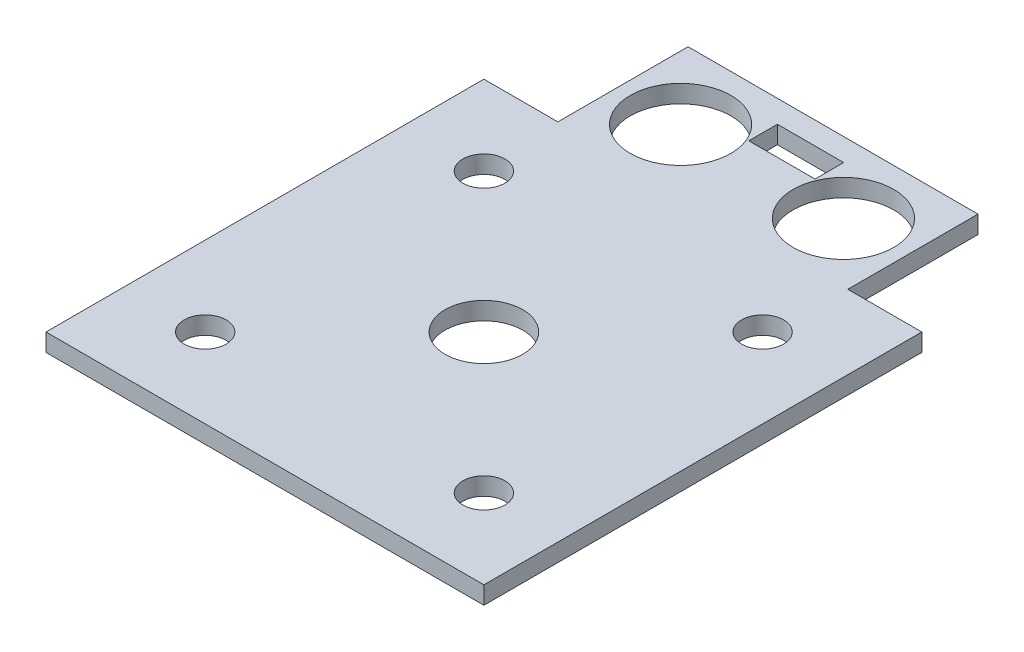
ISO-10303-21;
HEADER;
FILE_DESCRIPTION(('STEP AP214'),'2;1');
FILE_NAME('part.step','',(''),(''),'','','');
FILE_SCHEMA(('AUTOMOTIVE_DESIGN { 1 0 10303 214 1 1 1 1 }'));
ENDSEC;
DATA;
#1=APPLICATION_CONTEXT('core data for automotive mechanical design processes');
#2=APPLICATION_PROTOCOL_DEFINITION('international standard','automotive_design',2000,#1);
#3=PRODUCT_CONTEXT('',#1,'mechanical');
#4=PRODUCT('Part','Part','',(#3));
#5=PRODUCT_RELATED_PRODUCT_CATEGORY('part','',(#4));
#6=PRODUCT_DEFINITION_FORMATION('','',#4);
#7=PRODUCT_DEFINITION_CONTEXT('part definition',#1,'design');
#8=PRODUCT_DEFINITION('design','',#6,#7);
#9=PRODUCT_DEFINITION_SHAPE('','',#8);
#10=(LENGTH_UNIT() NAMED_UNIT(*) SI_UNIT(.MILLI.,.METRE.));
#11=(NAMED_UNIT(*) PLANE_ANGLE_UNIT() SI_UNIT($,.RADIAN.));
#12=(NAMED_UNIT(*) SI_UNIT($,.STERADIAN.) SOLID_ANGLE_UNIT());
#13=UNCERTAINTY_MEASURE_WITH_UNIT(LENGTH_MEASURE(1.E-05),#10,'distance_accuracy_value','');
#14=(GEOMETRIC_REPRESENTATION_CONTEXT(3) GLOBAL_UNCERTAINTY_ASSIGNED_CONTEXT((#13)) GLOBAL_UNIT_ASSIGNED_CONTEXT((#10,
#11,#12)) REPRESENTATION_CONTEXT('',''));
#15=CARTESIAN_POINT('',(0.,0.,0.));
#16=DIRECTION('',(0.,0.,1.));
#17=DIRECTION('',(1.,0.,0.));
#18=AXIS2_PLACEMENT_3D('',#15,#16,#17);
#19=CARTESIAN_POINT('',(0.,0.,0.));
#20=DIRECTION('',(0.,1.,0.));
#21=DIRECTION('',(0.,0.,1.));
#22=AXIS2_PLACEMENT_3D('',#19,#20,#21);
#23=PLANE('',#22);
#24=CARTESIAN_POINT('',(0.,0.,0.));
#25=DIRECTION('',(0.,1.,0.));
#26=DIRECTION('',(0.,0.,1.));
#27=AXIS2_PLACEMENT_3D('',#24,#25,#26);
#28=CIRCLE('',#27,21.);
#29=CARTESIAN_POINT('',(0.,0.,21.));
#30=VERTEX_POINT('',#29);
#31=EDGE_CURVE('E51',#30,#30,#28,.T.);
#32=ORIENTED_EDGE('',*,*,#31,.F.);
#33=EDGE_LOOP('',(#32));
#34=FACE_BOUND('',#33,.T.);
#35=CARTESIAN_POINT('',(0.,0.,0.));
#36=DIRECTION('',(0.,1.,0.));
#37=DIRECTION('',(0.,0.,1.));
#38=AXIS2_PLACEMENT_3D('',#35,#36,#37);
#39=CIRCLE('',#38,20.);
#40=CARTESIAN_POINT('',(0.,0.,20.));
#41=VERTEX_POINT('',#40);
#42=EDGE_CURVE('E205',#41,#41,#39,.T.);
#43=ORIENTED_EDGE('',*,*,#42,.T.);
#44=EDGE_LOOP('',(#43));
#45=FACE_BOUND('',#44,.T.);
#46=ADVANCED_FACE('F47',(#34,#45),#23,.F.);
#47=CARTESIAN_POINT('',(0.,3.5,0.));
#48=DIRECTION('',(0.,-1.,0.));
#49=DIRECTION('',(0.,0.,-1.));
#50=AXIS2_PLACEMENT_3D('',#47,#48,#49);
#51=CYLINDRICAL_SURFACE('',#50,21.);
#52=CARTESIAN_POINT('',(0.,3.5,0.));
#53=DIRECTION('',(0.,1.,0.));
#54=DIRECTION('',(0.,0.,1.));
#55=AXIS2_PLACEMENT_3D('',#52,#53,#54);
#56=CIRCLE('',#55,21.);
#57=CARTESIAN_POINT('',(0.,3.5,21.));
#58=VERTEX_POINT('',#57);
#59=EDGE_CURVE('E11',#58,#58,#56,.T.);
#60=ORIENTED_EDGE('',*,*,#59,.F.);
#61=EDGE_LOOP('',(#60));
#62=FACE_BOUND('',#61,.T.);
#63=ORIENTED_EDGE('',*,*,#31,.T.);
#64=EDGE_LOOP('',(#63));
#65=FACE_BOUND('',#64,.T.);
#66=ADVANCED_FACE('F49',(#62,#65),#51,.T.);
#67=CARTESIAN_POINT('',(0.,3.5,0.));
#68=DIRECTION('',(0.,-1.,0.));
#69=DIRECTION('',(0.,0.,-1.));
#70=AXIS2_PLACEMENT_3D('',#67,#68,#69);
#71=CYLINDRICAL_SURFACE('',#70,20.);
#72=CARTESIAN_POINT('',(0.,3.5,0.));
#73=DIRECTION('',(0.,1.,0.));
#74=DIRECTION('',(0.,0.,1.));
#75=AXIS2_PLACEMENT_3D('',#72,#73,#74);
#76=CIRCLE('',#75,20.);
#77=CARTESIAN_POINT('',(0.,3.5,20.));
#78=VERTEX_POINT('',#77);
#79=EDGE_CURVE('E173',#78,#78,#76,.T.);
#80=ORIENTED_EDGE('',*,*,#79,.T.);
#81=EDGE_LOOP('',(#80));
#82=FACE_BOUND('',#81,.T.);
#83=ORIENTED_EDGE('',*,*,#42,.F.);
#84=EDGE_LOOP('',(#83));
#85=FACE_BOUND('',#84,.T.);
#86=ADVANCED_FACE('F219',(#82,#85),#71,.F.);
#87=CARTESIAN_POINT('',(0.,3.5,0.));
#88=DIRECTION('',(0.,1.,0.));
#89=DIRECTION('',(0.,0.,1.));
#90=AXIS2_PLACEMENT_3D('',#87,#88,#89);
#91=PLANE('',#90);
#92=CARTESIAN_POINT('',(0.,3.5,0.));
#93=DIRECTION('',(0.,1.,0.));
#94=DIRECTION('',(0.,0.,1.));
#95=AXIS2_PLACEMENT_3D('',#92,#93,#94);
#96=CIRCLE('',#95,6.55);
#97=CARTESIAN_POINT('',(0.,3.5,6.55));
#98=VERTEX_POINT('',#97);
#99=EDGE_CURVE('E360',#98,#98,#96,.T.);
#100=ORIENTED_EDGE('',*,*,#99,.T.);
#101=EDGE_LOOP('',(#100));
#102=FACE_BOUND('',#101,.T.);
#103=ORIENTED_EDGE('',*,*,#79,.F.);
#104=EDGE_LOOP('',(#103));
#105=FACE_BOUND('',#104,.T.);
#106=ADVANCED_FACE('F224',(#102,#105),#91,.F.);
#107=CARTESIAN_POINT('',(5.6,6.5,0.));
#108=DIRECTION('',(-1.,0.,0.));
#109=DIRECTION('',(0.,0.,1.));
#110=AXIS2_PLACEMENT_3D('',#107,#108,#109);
#111=PLANE('',#110);
#112=DIRECTION('',(0.,0.,-1.));
#113=VECTOR('',#112,1.);
#114=CARTESIAN_POINT('',(5.6,3.5,0.));
#115=LINE('',#114,#113);
#116=CARTESIAN_POINT('',(5.6,3.5,-50.36));
#117=VERTEX_POINT('',#116);
#118=CARTESIAN_POINT('',(5.6,3.5,-55.2));
#119=VERTEX_POINT('',#118);
#120=EDGE_CURVE('E401',#117,#119,#115,.T.);
#121=ORIENTED_EDGE('',*,*,#120,.F.);
#122=DIRECTION('',(0.,-1.,0.));
#123=VECTOR('',#122,1.);
#124=CARTESIAN_POINT('',(5.6,6.5,-50.36));
#125=LINE('',#124,#123);
#126=CARTESIAN_POINT('',(5.6,6.5,-50.36));
#127=VERTEX_POINT('',#126);
#128=EDGE_CURVE('E169',#127,#117,#125,.T.);
#129=ORIENTED_EDGE('',*,*,#128,.F.);
#130=DIRECTION('',(0.,0.,-1.));
#131=VECTOR('',#130,1.);
#132=CARTESIAN_POINT('',(5.6,6.5,0.));
#133=LINE('',#132,#131);
#134=CARTESIAN_POINT('',(5.6,6.5,-55.2));
#135=VERTEX_POINT('',#134);
#136=EDGE_CURVE('E161',#127,#135,#133,.T.);
#137=ORIENTED_EDGE('',*,*,#136,.T.);
#138=DIRECTION('',(0.,-1.,0.));
#139=VECTOR('',#138,1.);
#140=CARTESIAN_POINT('',(5.6,6.5,-55.2));
#141=LINE('',#140,#139);
#142=EDGE_CURVE('E112',#135,#119,#141,.T.);
#143=ORIENTED_EDGE('',*,*,#142,.T.);
#144=EDGE_LOOP('',(#121,#129,#137,#143));
#145=FACE_BOUND('',#144,.T.);
#146=ADVANCED_FACE('F283',(#145),#111,.T.);
#147=CARTESIAN_POINT('',(0.,6.5,-50.36));
#148=DIRECTION('',(0.,0.,1.));
#149=DIRECTION('',(1.,0.,0.));
#150=AXIS2_PLACEMENT_3D('',#147,#148,#149);
#151=PLANE('',#150);
#152=DIRECTION('',(-1.,0.,0.));
#153=VECTOR('',#152,1.);
#154=CARTESIAN_POINT('',(0.,3.5,-50.36));
#155=LINE('',#154,#153);
#156=CARTESIAN_POINT('',(-5.6,3.5,-50.36));
#157=VERTEX_POINT('',#156);
#158=EDGE_CURVE('E167',#117,#157,#155,.T.);
#159=ORIENTED_EDGE('',*,*,#158,.T.);
#160=DIRECTION('',(0.,-1.,0.));
#161=VECTOR('',#160,1.);
#162=CARTESIAN_POINT('',(-5.6,6.5,-50.36));
#163=LINE('',#162,#161);
#164=CARTESIAN_POINT('',(-5.6,6.5,-50.36));
#165=VERTEX_POINT('',#164);
#166=EDGE_CURVE('E153',#165,#157,#163,.T.);
#167=ORIENTED_EDGE('',*,*,#166,.F.);
#168=DIRECTION('',(-1.,0.,0.));
#169=VECTOR('',#168,1.);
#170=CARTESIAN_POINT('',(0.,6.5,-50.36));
#171=LINE('',#170,#169);
#172=EDGE_CURVE('E157',#127,#165,#171,.T.);
#173=ORIENTED_EDGE('',*,*,#172,.F.);
#174=ORIENTED_EDGE('',*,*,#128,.T.);
#175=EDGE_LOOP('',(#159,#167,#173,#174));
#176=FACE_BOUND('',#175,.T.);
#177=ADVANCED_FACE('F165',(#176),#151,.F.);
#178=CARTESIAN_POINT('',(-5.6,6.5,0.));
#179=DIRECTION('',(-1.,0.,0.));
#180=DIRECTION('',(0.,0.,1.));
#181=AXIS2_PLACEMENT_3D('',#178,#179,#180);
#182=PLANE('',#181);
#183=DIRECTION('',(0.,0.,-1.));
#184=VECTOR('',#183,1.);
#185=CARTESIAN_POINT('',(-5.6,3.5,0.));
#186=LINE('',#185,#184);
#187=CARTESIAN_POINT('',(-5.6,3.5,-55.2));
#188=VERTEX_POINT('',#187);
#189=EDGE_CURVE('E406',#157,#188,#186,.T.);
#190=ORIENTED_EDGE('',*,*,#189,.T.);
#191=DIRECTION('',(0.,-1.,0.));
#192=VECTOR('',#191,1.);
#193=CARTESIAN_POINT('',(-5.6,6.5,-55.2));
#194=LINE('',#193,#192);
#195=CARTESIAN_POINT('',(-5.6,6.5,-55.2));
#196=VERTEX_POINT('',#195);
#197=EDGE_CURVE('E155',#196,#188,#194,.T.);
#198=ORIENTED_EDGE('',*,*,#197,.F.);
#199=DIRECTION('',(0.,0.,-1.));
#200=VECTOR('',#199,1.);
#201=CARTESIAN_POINT('',(-5.6,6.5,0.));
#202=LINE('',#201,#200);
#203=EDGE_CURVE('E148',#165,#196,#202,.T.);
#204=ORIENTED_EDGE('',*,*,#203,.F.);
#205=ORIENTED_EDGE('',*,*,#166,.T.);
#206=EDGE_LOOP('',(#190,#198,#204,#205));
#207=FACE_BOUND('',#206,.T.);
#208=ADVANCED_FACE('F151',(#207),#182,.F.);
#209=CARTESIAN_POINT('',(0.,6.5,37.));
#210=DIRECTION('',(0.,0.,-1.));
#211=DIRECTION('',(-1.,0.,0.));
#212=AXIS2_PLACEMENT_3D('',#209,#210,#211);
#213=PLANE('',#212);
#214=DIRECTION('',(1.,0.,0.));
#215=VECTOR('',#214,1.);
#216=CARTESIAN_POINT('',(0.,3.5,37.));
#217=LINE('',#216,#215);
#218=CARTESIAN_POINT('',(-37.,3.5,37.));
#219=VERTEX_POINT('',#218);
#220=CARTESIAN_POINT('',(37.,3.5,37.));
#221=VERTEX_POINT('',#220);
#222=EDGE_CURVE('E364',#219,#221,#217,.T.);
#223=ORIENTED_EDGE('',*,*,#222,.T.);
#224=DIRECTION('',(0.,-1.,0.));
#225=VECTOR('',#224,1.);
#226=CARTESIAN_POINT('',(37.,6.5,37.));
#227=LINE('',#226,#225);
#228=CARTESIAN_POINT('',(37.,6.5,37.));
#229=VERTEX_POINT('',#228);
#230=EDGE_CURVE('E199',#229,#221,#227,.T.);
#231=ORIENTED_EDGE('',*,*,#230,.F.);
#232=DIRECTION('',(1.,0.,0.));
#233=VECTOR('',#232,1.);
#234=CARTESIAN_POINT('',(0.,6.5,37.));
#235=LINE('',#234,#233);
#236=CARTESIAN_POINT('',(-37.,6.5,37.));
#237=VERTEX_POINT('',#236);
#238=EDGE_CURVE('E324',#237,#229,#235,.T.);
#239=ORIENTED_EDGE('',*,*,#238,.F.);
#240=DIRECTION('',(0.,-1.,0.));
#241=VECTOR('',#240,1.);
#242=CARTESIAN_POINT('',(-37.,6.5,37.));
#243=LINE('',#242,#241);
#244=EDGE_CURVE('E178',#237,#219,#243,.T.);
#245=ORIENTED_EDGE('',*,*,#244,.T.);
#246=EDGE_LOOP('',(#223,#231,#239,#245));
#247=FACE_BOUND('',#246,.T.);
#248=ADVANCED_FACE('F248',(#247),#213,.F.);
#249=CARTESIAN_POINT('',(37.,6.5,0.));
#250=DIRECTION('',(-1.,0.,0.));
#251=DIRECTION('',(0.,0.,1.));
#252=AXIS2_PLACEMENT_3D('',#249,#250,#251);
#253=PLANE('',#252);
#254=DIRECTION('',(0.,0.,-1.));
#255=VECTOR('',#254,1.);
#256=CARTESIAN_POINT('',(37.,3.5,0.));
#257=LINE('',#256,#255);
#258=CARTESIAN_POINT('',(37.,3.5,-37.));
#259=VERTEX_POINT('',#258);
#260=EDGE_CURVE('E368',#221,#259,#257,.T.);
#261=ORIENTED_EDGE('',*,*,#260,.T.);
#262=DIRECTION('',(0.,-1.,0.));
#263=VECTOR('',#262,1.);
#264=CARTESIAN_POINT('',(37.,6.5,-37.));
#265=LINE('',#264,#263);
#266=CARTESIAN_POINT('',(37.,6.5,-37.));
#267=VERTEX_POINT('',#266);
#268=EDGE_CURVE('E196',#267,#259,#265,.T.);
#269=ORIENTED_EDGE('',*,*,#268,.F.);
#270=DIRECTION('',(0.,0.,-1.));
#271=VECTOR('',#270,1.);
#272=CARTESIAN_POINT('',(37.,6.5,0.));
#273=LINE('',#272,#271);
#274=EDGE_CURVE('E120',#229,#267,#273,.T.);
#275=ORIENTED_EDGE('',*,*,#274,.F.);
#276=ORIENTED_EDGE('',*,*,#230,.T.);
#277=EDGE_LOOP('',(#261,#269,#275,#276));
#278=FACE_BOUND('',#277,.T.);
#279=ADVANCED_FACE('F251',(#278),#253,.F.);
#280=CARTESIAN_POINT('',(0.,6.5,-37.));
#281=DIRECTION('',(0.,0.,-1.));
#282=DIRECTION('',(-1.,0.,0.));
#283=AXIS2_PLACEMENT_3D('',#280,#281,#282);
#284=PLANE('',#283);
#285=DIRECTION('',(1.,0.,0.));
#286=VECTOR('',#285,1.);
#287=CARTESIAN_POINT('',(0.,3.5,-37.));
#288=LINE('',#287,#286);
#289=CARTESIAN_POINT('',(24.5,3.5,-37.));
#290=VERTEX_POINT('',#289);
#291=EDGE_CURVE('E372',#290,#259,#288,.T.);
#292=ORIENTED_EDGE('',*,*,#291,.F.);
#293=DIRECTION('',(0.,-1.,0.));
#294=VECTOR('',#293,1.);
#295=CARTESIAN_POINT('',(24.5,6.5,-37.));
#296=LINE('',#295,#294);
#297=CARTESIAN_POINT('',(24.5,6.5,-37.));
#298=VERTEX_POINT('',#297);
#299=EDGE_CURVE('E193',#298,#290,#296,.T.);
#300=ORIENTED_EDGE('',*,*,#299,.F.);
#301=DIRECTION('',(1.,0.,0.));
#302=VECTOR('',#301,1.);
#303=CARTESIAN_POINT('',(0.,6.5,-37.));
#304=LINE('',#303,#302);
#305=EDGE_CURVE('E426',#298,#267,#304,.T.);
#306=ORIENTED_EDGE('',*,*,#305,.T.);
#307=ORIENTED_EDGE('',*,*,#268,.T.);
#308=EDGE_LOOP('',(#292,#300,#306,#307));
#309=FACE_BOUND('',#308,.T.);
#310=ADVANCED_FACE('F255',(#309),#284,.T.);
#311=CARTESIAN_POINT('',(24.5,6.5,0.));
#312=DIRECTION('',(1.,0.,0.));
#313=DIRECTION('',(0.,0.,-1.));
#314=AXIS2_PLACEMENT_3D('',#311,#312,#313);
#315=PLANE('',#314);
#316=DIRECTION('',(0.,0.,1.));
#317=VECTOR('',#316,1.);
#318=CARTESIAN_POINT('',(24.5,3.5,0.));
#319=LINE('',#318,#317);
#320=CARTESIAN_POINT('',(24.5,3.5,-59.));
#321=VERTEX_POINT('',#320);
#322=EDGE_CURVE('E376',#321,#290,#319,.T.);
#323=ORIENTED_EDGE('',*,*,#322,.F.);
#324=DIRECTION('',(0.,-1.,0.));
#325=VECTOR('',#324,1.);
#326=CARTESIAN_POINT('',(24.5,6.5,-59.));
#327=LINE('',#326,#325);
#328=CARTESIAN_POINT('',(24.5,6.5,-59.));
#329=VERTEX_POINT('',#328);
#330=EDGE_CURVE('E190',#329,#321,#327,.T.);
#331=ORIENTED_EDGE('',*,*,#330,.F.);
#332=DIRECTION('',(0.,0.,1.));
#333=VECTOR('',#332,1.);
#334=CARTESIAN_POINT('',(24.5,6.5,0.));
#335=LINE('',#334,#333);
#336=EDGE_CURVE('E430',#329,#298,#335,.T.);
#337=ORIENTED_EDGE('',*,*,#336,.T.);
#338=ORIENTED_EDGE('',*,*,#299,.T.);
#339=EDGE_LOOP('',(#323,#331,#337,#338));
#340=FACE_BOUND('',#339,.T.);
#341=ADVANCED_FACE('F256',(#340),#315,.T.);
#342=CARTESIAN_POINT('',(0.,6.5,-59.));
#343=DIRECTION('',(0.,0.,-1.));
#344=DIRECTION('',(-1.,0.,0.));
#345=AXIS2_PLACEMENT_3D('',#342,#343,#344);
#346=PLANE('',#345);
#347=DIRECTION('',(1.,0.,0.));
#348=VECTOR('',#347,1.);
#349=CARTESIAN_POINT('',(0.,3.5,-59.));
#350=LINE('',#349,#348);
#351=CARTESIAN_POINT('',(-24.5,3.5,-59.));
#352=VERTEX_POINT('',#351);
#353=EDGE_CURVE('E381',#352,#321,#350,.T.);
#354=ORIENTED_EDGE('',*,*,#353,.F.);
#355=DIRECTION('',(0.,-1.,0.));
#356=VECTOR('',#355,1.);
#357=CARTESIAN_POINT('',(-24.5,6.5,-59.));
#358=LINE('',#357,#356);
#359=CARTESIAN_POINT('',(-24.5,6.5,-59.));
#360=VERTEX_POINT('',#359);
#361=EDGE_CURVE('E187',#360,#352,#358,.T.);
#362=ORIENTED_EDGE('',*,*,#361,.F.);
#363=DIRECTION('',(1.,0.,0.));
#364=VECTOR('',#363,1.);
#365=CARTESIAN_POINT('',(0.,6.5,-59.));
#366=LINE('',#365,#364);
#367=EDGE_CURVE('E435',#360,#329,#366,.T.);
#368=ORIENTED_EDGE('',*,*,#367,.T.);
#369=ORIENTED_EDGE('',*,*,#330,.T.);
#370=EDGE_LOOP('',(#354,#362,#368,#369));
#371=FACE_BOUND('',#370,.T.);
#372=ADVANCED_FACE('F259',(#371),#346,.T.);
#373=CARTESIAN_POINT('',(-24.5,6.5,0.));
#374=DIRECTION('',(-1.,0.,0.));
#375=DIRECTION('',(0.,0.,1.));
#376=AXIS2_PLACEMENT_3D('',#373,#374,#375);
#377=PLANE('',#376);
#378=DIRECTION('',(0.,0.,-1.));
#379=VECTOR('',#378,1.);
#380=CARTESIAN_POINT('',(-24.5,3.5,0.));
#381=LINE('',#380,#379);
#382=CARTESIAN_POINT('',(-24.5,3.5,-37.));
#383=VERTEX_POINT('',#382);
#384=EDGE_CURVE('E385',#383,#352,#381,.T.);
#385=ORIENTED_EDGE('',*,*,#384,.F.);
#386=DIRECTION('',(0.,-1.,0.));
#387=VECTOR('',#386,1.);
#388=CARTESIAN_POINT('',(-24.5,6.5,-37.));
#389=LINE('',#388,#387);
#390=CARTESIAN_POINT('',(-24.5,6.5,-37.));
#391=VERTEX_POINT('',#390);
#392=EDGE_CURVE('E184',#391,#383,#389,.T.);
#393=ORIENTED_EDGE('',*,*,#392,.F.);
#394=DIRECTION('',(0.,0.,-1.));
#395=VECTOR('',#394,1.);
#396=CARTESIAN_POINT('',(-24.5,6.5,0.));
#397=LINE('',#396,#395);
#398=EDGE_CURVE('E439',#391,#360,#397,.T.);
#399=ORIENTED_EDGE('',*,*,#398,.T.);
#400=ORIENTED_EDGE('',*,*,#361,.T.);
#401=EDGE_LOOP('',(#385,#393,#399,#400));
#402=FACE_BOUND('',#401,.T.);
#403=ADVANCED_FACE('F263',(#402),#377,.T.);
#404=CARTESIAN_POINT('',(-37.,3.5,-37.));
#405=VERTEX_POINT('',#404);
#406=EDGE_CURVE('E377',#405,#383,#288,.T.);
#407=ORIENTED_EDGE('',*,*,#406,.F.);
#408=DIRECTION('',(0.,-1.,0.));
#409=VECTOR('',#408,1.);
#410=CARTESIAN_POINT('',(-37.,6.5,-37.));
#411=LINE('',#410,#409);
#412=CARTESIAN_POINT('',(-37.,6.5,-37.));
#413=VERTEX_POINT('',#412);
#414=EDGE_CURVE('E181',#413,#405,#411,.T.);
#415=ORIENTED_EDGE('',*,*,#414,.F.);
#416=EDGE_CURVE('E431',#413,#391,#304,.T.);
#417=ORIENTED_EDGE('',*,*,#416,.T.);
#418=ORIENTED_EDGE('',*,*,#392,.T.);
#419=EDGE_LOOP('',(#407,#415,#417,#418));
#420=FACE_BOUND('',#419,.T.);
#421=ADVANCED_FACE('F267',(#420),#284,.T.);
#422=CARTESIAN_POINT('',(-13.76,6.5,-47.));
#423=DIRECTION('',(0.,-1.,0.));
#424=DIRECTION('',(0.,0.,-1.));
#425=AXIS2_PLACEMENT_3D('',#422,#423,#424);
#426=CYLINDRICAL_SURFACE('',#425,8.5);
#427=CARTESIAN_POINT('',(-13.76,6.5,-47.));
#428=DIRECTION('',(0.,1.,0.));
#429=DIRECTION('',(0.,0.,1.));
#430=AXIS2_PLACEMENT_3D('',#427,#428,#429);
#431=CIRCLE('',#430,8.5);
#432=CARTESIAN_POINT('',(-13.76,6.5,-38.5));
#433=VERTEX_POINT('',#432);
#434=EDGE_CURVE('E332',#433,#433,#431,.T.);
#435=ORIENTED_EDGE('',*,*,#434,.T.);
#436=EDGE_LOOP('',(#435));
#437=FACE_BOUND('',#436,.T.);
#438=CARTESIAN_POINT('',(-13.76,3.5,-47.));
#439=DIRECTION('',(0.,1.,0.));
#440=DIRECTION('',(0.,0.,1.));
#441=AXIS2_PLACEMENT_3D('',#438,#439,#440);
#442=CIRCLE('',#441,8.5);
#443=CARTESIAN_POINT('',(-13.76,3.5,-38.5));
#444=VERTEX_POINT('',#443);
#445=EDGE_CURVE('E397',#444,#444,#442,.T.);
#446=ORIENTED_EDGE('',*,*,#445,.F.);
#447=EDGE_LOOP('',(#446));
#448=FACE_BOUND('',#447,.T.);
#449=ADVANCED_FACE('F271',(#437,#448),#426,.F.);
#450=CARTESIAN_POINT('',(13.76,6.5,-47.));
#451=DIRECTION('',(0.,-1.,0.));
#452=DIRECTION('',(0.,0.,-1.));
#453=AXIS2_PLACEMENT_3D('',#450,#451,#452);
#454=CYLINDRICAL_SURFACE('',#453,8.5);
#455=CARTESIAN_POINT('',(13.76,6.5,-47.));
#456=DIRECTION('',(0.,1.,0.));
#457=DIRECTION('',(0.,0.,1.));
#458=AXIS2_PLACEMENT_3D('',#455,#456,#457);
#459=CIRCLE('',#458,8.5);
#460=CARTESIAN_POINT('',(13.76,6.5,-38.5));
#461=VERTEX_POINT('',#460);
#462=EDGE_CURVE('E329',#461,#461,#459,.T.);
#463=ORIENTED_EDGE('',*,*,#462,.T.);
#464=EDGE_LOOP('',(#463));
#465=FACE_BOUND('',#464,.T.);
#466=CARTESIAN_POINT('',(13.76,3.5,-47.));
#467=DIRECTION('',(0.,1.,0.));
#468=DIRECTION('',(0.,0.,1.));
#469=AXIS2_PLACEMENT_3D('',#466,#467,#468);
#470=CIRCLE('',#469,8.5);
#471=CARTESIAN_POINT('',(13.76,3.5,-38.5));
#472=VERTEX_POINT('',#471);
#473=EDGE_CURVE('E393',#472,#472,#470,.T.);
#474=ORIENTED_EDGE('',*,*,#473,.F.);
#475=EDGE_LOOP('',(#474));
#476=FACE_BOUND('',#475,.T.);
#477=ADVANCED_FACE('F275',(#465,#476),#454,.F.);
#478=CARTESIAN_POINT('',(-37.,6.5,0.));
#479=DIRECTION('',(-1.,0.,0.));
#480=DIRECTION('',(0.,0.,1.));
#481=AXIS2_PLACEMENT_3D('',#478,#479,#480);
#482=PLANE('',#481);
#483=DIRECTION('',(0.,0.,-1.));
#484=VECTOR('',#483,1.);
#485=CARTESIAN_POINT('',(-37.,3.5,0.));
#486=LINE('',#485,#484);
#487=EDGE_CURVE('E389',#219,#405,#486,.T.);
#488=ORIENTED_EDGE('',*,*,#487,.F.);
#489=ORIENTED_EDGE('',*,*,#244,.F.);
#490=DIRECTION('',(0.,0.,-1.));
#491=VECTOR('',#490,1.);
#492=CARTESIAN_POINT('',(-37.,6.5,0.));
#493=LINE('',#492,#491);
#494=EDGE_CURVE('E338',#237,#413,#493,.T.);
#495=ORIENTED_EDGE('',*,*,#494,.T.);
#496=ORIENTED_EDGE('',*,*,#414,.T.);
#497=EDGE_LOOP('',(#488,#489,#495,#496));
#498=FACE_BOUND('',#497,.T.);
#499=ADVANCED_FACE('F246',(#498),#482,.T.);
#500=CARTESIAN_POINT('',(0.,6.5,0.));
#501=DIRECTION('',(0.,-1.,0.));
#502=DIRECTION('',(0.,0.,-1.));
#503=AXIS2_PLACEMENT_3D('',#500,#501,#502);
#504=CYLINDRICAL_SURFACE('',#503,6.55);
#505=CARTESIAN_POINT('',(0.,6.5,0.));
#506=DIRECTION('',(0.,1.,0.));
#507=DIRECTION('',(0.,0.,1.));
#508=AXIS2_PLACEMENT_3D('',#505,#506,#507);
#509=CIRCLE('',#508,6.55);
#510=CARTESIAN_POINT('',(0.,6.5,6.55));
#511=VERTEX_POINT('',#510);
#512=EDGE_CURVE('E320',#511,#511,#509,.T.);
#513=ORIENTED_EDGE('',*,*,#512,.T.);
#514=EDGE_LOOP('',(#513));
#515=FACE_BOUND('',#514,.T.);
#516=ORIENTED_EDGE('',*,*,#99,.F.);
#517=EDGE_LOOP('',(#516));
#518=FACE_BOUND('',#517,.T.);
#519=ADVANCED_FACE('F242',(#515,#518),#504,.F.);
#520=CARTESIAN_POINT('',(-23.55,6.5,-23.55));
#521=DIRECTION('',(0.,-1.,0.));
#522=DIRECTION('',(0.,0.,-1.));
#523=AXIS2_PLACEMENT_3D('',#520,#521,#522);
#524=CYLINDRICAL_SURFACE('',#523,3.55);
#525=CARTESIAN_POINT('',(-23.55,6.5,-23.55));
#526=DIRECTION('',(0.,1.,0.));
#527=DIRECTION('',(0.,0.,1.));
#528=AXIS2_PLACEMENT_3D('',#525,#526,#527);
#529=CIRCLE('',#528,3.55);
#530=CARTESIAN_POINT('',(-23.55,6.5,-20.));
#531=VERTEX_POINT('',#530);
#532=EDGE_CURVE('E316',#531,#531,#529,.T.);
#533=ORIENTED_EDGE('',*,*,#532,.T.);
#534=EDGE_LOOP('',(#533));
#535=FACE_BOUND('',#534,.T.);
#536=CARTESIAN_POINT('',(-23.55,3.5,-23.55));
#537=DIRECTION('',(0.,1.,0.));
#538=DIRECTION('',(0.,0.,1.));
#539=AXIS2_PLACEMENT_3D('',#536,#537,#538);
#540=CIRCLE('',#539,3.55);
#541=CARTESIAN_POINT('',(-23.55,3.5,-20.));
#542=VERTEX_POINT('',#541);
#543=EDGE_CURVE('E356',#542,#542,#540,.T.);
#544=ORIENTED_EDGE('',*,*,#543,.F.);
#545=EDGE_LOOP('',(#544));
#546=FACE_BOUND('',#545,.T.);
#547=ADVANCED_FACE('F238',(#535,#546),#524,.F.);
#548=CARTESIAN_POINT('',(23.55,6.5,-23.55));
#549=DIRECTION('',(0.,-1.,0.));
#550=DIRECTION('',(0.,0.,-1.));
#551=AXIS2_PLACEMENT_3D('',#548,#549,#550);
#552=CYLINDRICAL_SURFACE('',#551,3.55);
#553=CARTESIAN_POINT('',(23.55,6.5,-23.55));
#554=DIRECTION('',(0.,1.,0.));
#555=DIRECTION('',(0.,0.,1.));
#556=AXIS2_PLACEMENT_3D('',#553,#554,#555);
#557=CIRCLE('',#556,3.55);
#558=CARTESIAN_POINT('',(23.55,6.5,-20.));
#559=VERTEX_POINT('',#558);
#560=EDGE_CURVE('E312',#559,#559,#557,.T.);
#561=ORIENTED_EDGE('',*,*,#560,.T.);
#562=EDGE_LOOP('',(#561));
#563=FACE_BOUND('',#562,.T.);
#564=CARTESIAN_POINT('',(23.55,3.5,-23.55));
#565=DIRECTION('',(0.,1.,0.));
#566=DIRECTION('',(0.,0.,1.));
#567=AXIS2_PLACEMENT_3D('',#564,#565,#566);
#568=CIRCLE('',#567,3.55);
#569=CARTESIAN_POINT('',(23.55,3.5,-20.));
#570=VERTEX_POINT('',#569);
#571=EDGE_CURVE('E352',#570,#570,#568,.T.);
#572=ORIENTED_EDGE('',*,*,#571,.F.);
#573=EDGE_LOOP('',(#572));
#574=FACE_BOUND('',#573,.T.);
#575=ADVANCED_FACE('F234',(#563,#574),#552,.F.);
#576=CARTESIAN_POINT('',(23.55,6.5,23.55));
#577=DIRECTION('',(0.,-1.,0.));
#578=DIRECTION('',(0.,0.,-1.));
#579=AXIS2_PLACEMENT_3D('',#576,#577,#578);
#580=CYLINDRICAL_SURFACE('',#579,3.55);
#581=CARTESIAN_POINT('',(23.55,6.5,23.55));
#582=DIRECTION('',(0.,1.,0.));
#583=DIRECTION('',(0.,0.,1.));
#584=AXIS2_PLACEMENT_3D('',#581,#582,#583);
#585=CIRCLE('',#584,3.55);
#586=CARTESIAN_POINT('',(23.55,6.5,27.1));
#587=VERTEX_POINT('',#586);
#588=EDGE_CURVE('E308',#587,#587,#585,.T.);
#589=ORIENTED_EDGE('',*,*,#588,.T.);
#590=EDGE_LOOP('',(#589));
#591=FACE_BOUND('',#590,.T.);
#592=CARTESIAN_POINT('',(23.55,3.5,23.55));
#593=DIRECTION('',(0.,1.,0.));
#594=DIRECTION('',(0.,0.,1.));
#595=AXIS2_PLACEMENT_3D('',#592,#593,#594);
#596=CIRCLE('',#595,3.55);
#597=CARTESIAN_POINT('',(23.55,3.5,27.1));
#598=VERTEX_POINT('',#597);
#599=EDGE_CURVE('E348',#598,#598,#596,.T.);
#600=ORIENTED_EDGE('',*,*,#599,.F.);
#601=EDGE_LOOP('',(#600));
#602=FACE_BOUND('',#601,.T.);
#603=ADVANCED_FACE('F230',(#591,#602),#580,.F.);
#604=CARTESIAN_POINT('',(-23.55,6.5,23.55));
#605=DIRECTION('',(0.,-1.,0.));
#606=DIRECTION('',(0.,0.,-1.));
#607=AXIS2_PLACEMENT_3D('',#604,#605,#606);
#608=CYLINDRICAL_SURFACE('',#607,3.55);
#609=CARTESIAN_POINT('',(-23.55,6.5,23.55));
#610=DIRECTION('',(0.,1.,0.));
#611=DIRECTION('',(0.,0.,1.));
#612=AXIS2_PLACEMENT_3D('',#609,#610,#611);
#613=CIRCLE('',#612,3.55);
#614=CARTESIAN_POINT('',(-23.55,6.5,27.1));
#615=VERTEX_POINT('',#614);
#616=EDGE_CURVE('E304',#615,#615,#613,.T.);
#617=ORIENTED_EDGE('',*,*,#616,.T.);
#618=EDGE_LOOP('',(#617));
#619=FACE_BOUND('',#618,.T.);
#620=CARTESIAN_POINT('',(-23.55,3.5,23.55));
#621=DIRECTION('',(0.,1.,0.));
#622=DIRECTION('',(0.,0.,1.));
#623=AXIS2_PLACEMENT_3D('',#620,#621,#622);
#624=CIRCLE('',#623,3.55);
#625=CARTESIAN_POINT('',(-23.55,3.5,27.1));
#626=VERTEX_POINT('',#625);
#627=EDGE_CURVE('E344',#626,#626,#624,.T.);
#628=ORIENTED_EDGE('',*,*,#627,.F.);
#629=EDGE_LOOP('',(#628));
#630=FACE_BOUND('',#629,.T.);
#631=ADVANCED_FACE('F226',(#619,#630),#608,.F.);
#632=CARTESIAN_POINT('',(0.,6.5,-55.2));
#633=DIRECTION('',(0.,0.,-1.));
#634=DIRECTION('',(-1.,0.,0.));
#635=AXIS2_PLACEMENT_3D('',#632,#633,#634);
#636=PLANE('',#635);
#637=DIRECTION('',(1.,0.,0.));
#638=VECTOR('',#637,1.);
#639=CARTESIAN_POINT('',(0.,3.5,-55.2));
#640=LINE('',#639,#638);
#641=EDGE_CURVE('E105',#188,#119,#640,.T.);
#642=ORIENTED_EDGE('',*,*,#641,.T.);
#643=ORIENTED_EDGE('',*,*,#142,.F.);
#644=DIRECTION('',(1.,0.,0.));
#645=VECTOR('',#644,1.);
#646=CARTESIAN_POINT('',(0.,6.5,-55.2));
#647=LINE('',#646,#645);
#648=EDGE_CURVE('E65',#196,#135,#647,.T.);
#649=ORIENTED_EDGE('',*,*,#648,.F.);
#650=ORIENTED_EDGE('',*,*,#197,.T.);
#651=EDGE_LOOP('',(#642,#643,#649,#650));
#652=FACE_BOUND('',#651,.T.);
#653=ADVANCED_FACE('F229',(#652),#636,.F.);
#654=CARTESIAN_POINT('',(0.,6.5,0.));
#655=DIRECTION('',(0.,1.,0.));
#656=DIRECTION('',(0.,0.,1.));
#657=AXIS2_PLACEMENT_3D('',#654,#655,#656);
#658=PLANE('',#657);
#659=ORIENTED_EDGE('',*,*,#616,.F.);
#660=EDGE_LOOP('',(#659));
#661=FACE_BOUND('',#660,.T.);
#662=ORIENTED_EDGE('',*,*,#588,.F.);
#663=EDGE_LOOP('',(#662));
#664=FACE_BOUND('',#663,.T.);
#665=ORIENTED_EDGE('',*,*,#560,.F.);
#666=EDGE_LOOP('',(#665));
#667=FACE_BOUND('',#666,.T.);
#668=ORIENTED_EDGE('',*,*,#532,.F.);
#669=EDGE_LOOP('',(#668));
#670=FACE_BOUND('',#669,.T.);
#671=ORIENTED_EDGE('',*,*,#512,.F.);
#672=EDGE_LOOP('',(#671));
#673=FACE_BOUND('',#672,.T.);
#674=ORIENTED_EDGE('',*,*,#238,.T.);
#675=ORIENTED_EDGE('',*,*,#274,.T.);
#676=ORIENTED_EDGE('',*,*,#305,.F.);
#677=ORIENTED_EDGE('',*,*,#336,.F.);
#678=ORIENTED_EDGE('',*,*,#367,.F.);
#679=ORIENTED_EDGE('',*,*,#398,.F.);
#680=ORIENTED_EDGE('',*,*,#416,.F.);
#681=ORIENTED_EDGE('',*,*,#494,.F.);
#682=EDGE_LOOP('',(#674,#675,#676,#677,#678,#679,#680,#681));
#683=FACE_BOUND('',#682,.T.);
#684=ORIENTED_EDGE('',*,*,#462,.F.);
#685=EDGE_LOOP('',(#684));
#686=FACE_BOUND('',#685,.T.);
#687=ORIENTED_EDGE('',*,*,#434,.F.);
#688=EDGE_LOOP('',(#687));
#689=FACE_BOUND('',#688,.T.);
#690=ORIENTED_EDGE('',*,*,#136,.F.);
#691=ORIENTED_EDGE('',*,*,#172,.T.);
#692=ORIENTED_EDGE('',*,*,#203,.T.);
#693=ORIENTED_EDGE('',*,*,#648,.T.);
#694=EDGE_LOOP('',(#690,#691,#692,#693));
#695=FACE_BOUND('',#694,.T.);
#696=ADVANCED_FACE('F160',(#661,#664,#667,#670,#673,#683,#686,#689,#695),#658,.T.);
#697=ORIENTED_EDGE('',*,*,#59,.T.);
#698=EDGE_LOOP('',(#697));
#699=FACE_BOUND('',#698,.T.);
#700=ORIENTED_EDGE('',*,*,#627,.T.);
#701=EDGE_LOOP('',(#700));
#702=FACE_BOUND('',#701,.T.);
#703=ORIENTED_EDGE('',*,*,#599,.T.);
#704=EDGE_LOOP('',(#703));
#705=FACE_BOUND('',#704,.T.);
#706=ORIENTED_EDGE('',*,*,#571,.T.);
#707=EDGE_LOOP('',(#706));
#708=FACE_BOUND('',#707,.T.);
#709=ORIENTED_EDGE('',*,*,#543,.T.);
#710=EDGE_LOOP('',(#709));
#711=FACE_BOUND('',#710,.T.);
#712=ORIENTED_EDGE('',*,*,#222,.F.);
#713=ORIENTED_EDGE('',*,*,#487,.T.);
#714=ORIENTED_EDGE('',*,*,#406,.T.);
#715=ORIENTED_EDGE('',*,*,#384,.T.);
#716=ORIENTED_EDGE('',*,*,#353,.T.);
#717=ORIENTED_EDGE('',*,*,#322,.T.);
#718=ORIENTED_EDGE('',*,*,#291,.T.);
#719=ORIENTED_EDGE('',*,*,#260,.F.);
#720=EDGE_LOOP('',(#712,#713,#714,#715,#716,#717,#718,#719));
#721=FACE_BOUND('',#720,.T.);
#722=ORIENTED_EDGE('',*,*,#473,.T.);
#723=EDGE_LOOP('',(#722));
#724=FACE_BOUND('',#723,.T.);
#725=ORIENTED_EDGE('',*,*,#445,.T.);
#726=EDGE_LOOP('',(#725));
#727=FACE_BOUND('',#726,.T.);
#728=ORIENTED_EDGE('',*,*,#120,.T.);
#729=ORIENTED_EDGE('',*,*,#641,.F.);
#730=ORIENTED_EDGE('',*,*,#189,.F.);
#731=ORIENTED_EDGE('',*,*,#158,.F.);
#732=EDGE_LOOP('',(#728,#729,#730,#731));
#733=FACE_BOUND('',#732,.T.);
#734=ADVANCED_FACE('F293',(#699,#702,#705,#708,#711,#721,#724,#727,#733),#91,.F.);
#735=CLOSED_SHELL('',(#46,#66,#86,#106,#146,#177,#208,#248,#279,#310,#341,#372,#403,#421,#449,
#477,#499,#519,#547,#575,#603,#631,#653,#696,#734));
#736=MANIFOLD_SOLID_BREP('B2',#735);
#737=ADVANCED_BREP_SHAPE_REPRESENTATION('',(#18,#736),#14);
#738=SHAPE_DEFINITION_REPRESENTATION(#9,#737);
ENDSEC;
END-ISO-10303-21;
